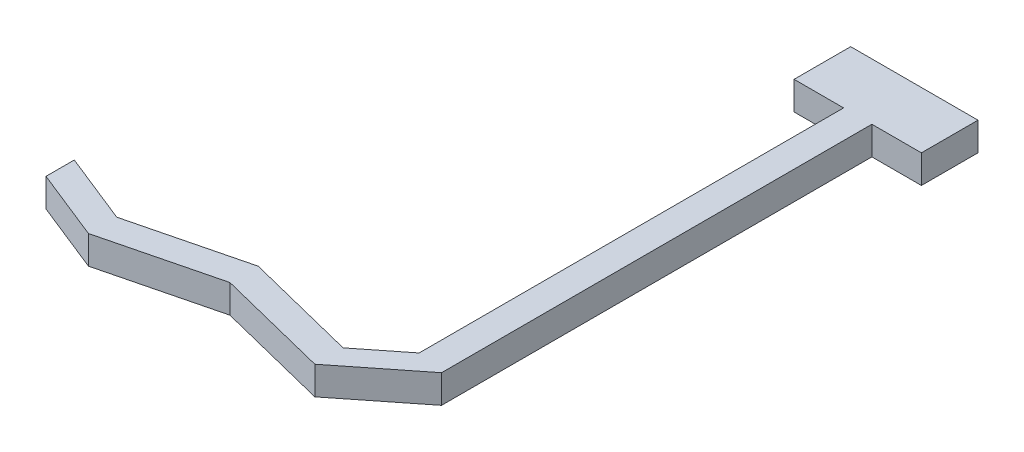
ISO-10303-21;
HEADER;
FILE_DESCRIPTION(('STEP AP214'),'2;1');
FILE_NAME('part.step','',(''),(''),'','','');
FILE_SCHEMA(('AUTOMOTIVE_DESIGN { 1 0 10303 214 1 1 1 1 }'));
ENDSEC;
DATA;
#1=APPLICATION_CONTEXT('core data for automotive mechanical design processes');
#2=APPLICATION_PROTOCOL_DEFINITION('international standard','automotive_design',2000,#1);
#3=PRODUCT_CONTEXT('',#1,'mechanical');
#4=PRODUCT('Part','Part','',(#3));
#5=PRODUCT_RELATED_PRODUCT_CATEGORY('part','',(#4));
#6=PRODUCT_DEFINITION_FORMATION('','',#4);
#7=PRODUCT_DEFINITION_CONTEXT('part definition',#1,'design');
#8=PRODUCT_DEFINITION('design','',#6,#7);
#9=PRODUCT_DEFINITION_SHAPE('','',#8);
#10=(LENGTH_UNIT() NAMED_UNIT(*) SI_UNIT(.MILLI.,.METRE.));
#11=(NAMED_UNIT(*) PLANE_ANGLE_UNIT() SI_UNIT($,.RADIAN.));
#12=(NAMED_UNIT(*) SI_UNIT($,.STERADIAN.) SOLID_ANGLE_UNIT());
#13=UNCERTAINTY_MEASURE_WITH_UNIT(LENGTH_MEASURE(1.E-05),#10,'distance_accuracy_value','');
#14=(GEOMETRIC_REPRESENTATION_CONTEXT(3) GLOBAL_UNCERTAINTY_ASSIGNED_CONTEXT((#13)) GLOBAL_UNIT_ASSIGNED_CONTEXT((#10,
#11,#12)) REPRESENTATION_CONTEXT('',''));
#15=CARTESIAN_POINT('',(0.,0.,0.));
#16=DIRECTION('',(0.,0.,1.));
#17=DIRECTION('',(1.,0.,0.));
#18=AXIS2_PLACEMENT_3D('',#15,#16,#17);
#19=CARTESIAN_POINT('',(-5.,2.,3.95990333794194));
#20=DIRECTION('',(-0.620854250213827,0.,-0.783926016911945));
#21=DIRECTION('',(-0.783926016911945,0.,0.620854250213827));
#22=AXIS2_PLACEMENT_3D('',#19,#20,#21);
#23=PLANE('',#22);
#24=DIRECTION('',(0.783926016911944,0.,-0.620854250213827));
#25=VECTOR('',#24,1.);
#26=CARTESIAN_POINT('',(-5.,0.,3.95990333794194));
#27=LINE('',#26,#25);
#28=CARTESIAN_POINT('',(-5.,0.,3.95990333794194));
#29=VERTEX_POINT('',#28);
#30=CARTESIAN_POINT('',(0.,0.,0.));
#31=VERTEX_POINT('',#30);
#32=EDGE_CURVE('E177',#29,#31,#27,.T.);
#33=ORIENTED_EDGE('',*,*,#32,.T.);
#34=DIRECTION('',(0.,-1.,0.));
#35=VECTOR('',#34,1.);
#36=CARTESIAN_POINT('',(0.,2.,0.));
#37=LINE('',#36,#35);
#38=CARTESIAN_POINT('',(0.,2.,0.));
#39=VERTEX_POINT('',#38);
#40=EDGE_CURVE('E11',#39,#31,#37,.T.);
#41=ORIENTED_EDGE('',*,*,#40,.F.);
#42=DIRECTION('',(0.783926016911944,0.,-0.620854250213827));
#43=VECTOR('',#42,1.);
#44=CARTESIAN_POINT('',(-5.,2.,3.95990333794194));
#45=LINE('',#44,#43);
#46=CARTESIAN_POINT('',(-5.,2.,3.95990333794194));
#47=VERTEX_POINT('',#46);
#48=EDGE_CURVE('E207',#47,#39,#45,.T.);
#49=ORIENTED_EDGE('',*,*,#48,.F.);
#50=DIRECTION('',(0.,-1.,0.));
#51=VECTOR('',#50,1.);
#52=CARTESIAN_POINT('',(-5.,2.,3.95990333794194));
#53=LINE('',#52,#51);
#54=EDGE_CURVE('E173',#47,#29,#53,.T.);
#55=ORIENTED_EDGE('',*,*,#54,.T.);
#56=EDGE_LOOP('',(#33,#41,#49,#55));
#57=FACE_BOUND('',#56,.T.);
#58=ADVANCED_FACE('F33',(#57),#23,.F.);
#59=CARTESIAN_POINT('',(0.,2.,0.));
#60=DIRECTION('',(-1.,0.,0.));
#61=DIRECTION('',(0.,0.,1.));
#62=AXIS2_PLACEMENT_3D('',#59,#60,#61);
#63=PLANE('',#62);
#64=DIRECTION('',(0.,0.,-1.));
#65=VECTOR('',#64,1.);
#66=CARTESIAN_POINT('',(0.,0.,0.));
#67=LINE('',#66,#65);
#68=CARTESIAN_POINT('',(0.,0.,-30.4160386648232));
#69=VERTEX_POINT('',#68);
#70=EDGE_CURVE('E180',#31,#69,#67,.T.);
#71=ORIENTED_EDGE('',*,*,#70,.T.);
#72=DIRECTION('',(0.,-1.,0.));
#73=VECTOR('',#72,1.);
#74=CARTESIAN_POINT('',(0.,2.,-30.4160386648232));
#75=LINE('',#74,#73);
#76=CARTESIAN_POINT('',(0.,2.,-30.4160386648232));
#77=VERTEX_POINT('',#76);
#78=EDGE_CURVE('E41',#77,#69,#75,.T.);
#79=ORIENTED_EDGE('',*,*,#78,.F.);
#80=DIRECTION('',(0.,0.,-1.));
#81=VECTOR('',#80,1.);
#82=CARTESIAN_POINT('',(0.,2.,0.));
#83=LINE('',#82,#81);
#84=EDGE_CURVE('E116',#39,#77,#83,.T.);
#85=ORIENTED_EDGE('',*,*,#84,.F.);
#86=ORIENTED_EDGE('',*,*,#40,.T.);
#87=EDGE_LOOP('',(#71,#79,#85,#86));
#88=FACE_BOUND('',#87,.T.);
#89=ADVANCED_FACE('F305',(#88),#63,.F.);
#90=CARTESIAN_POINT('',(0.,2.,-30.4160386648232));
#91=DIRECTION('',(0.,0.,-1.));
#92=DIRECTION('',(-1.,0.,0.));
#93=AXIS2_PLACEMENT_3D('',#90,#91,#92);
#94=PLANE('',#93);
#95=DIRECTION('',(1.,0.,0.));
#96=VECTOR('',#95,1.);
#97=CARTESIAN_POINT('',(0.,0.,-30.4160386648232));
#98=LINE('',#97,#96);
#99=CARTESIAN_POINT('',(3.5,0.,-30.4160386648232));
#100=VERTEX_POINT('',#99);
#101=EDGE_CURVE('E182',#69,#100,#98,.T.);
#102=ORIENTED_EDGE('',*,*,#101,.T.);
#103=DIRECTION('',(0.,-1.,0.));
#104=VECTOR('',#103,1.);
#105=CARTESIAN_POINT('',(3.5,2.,-30.4160386648232));
#106=LINE('',#105,#104);
#107=CARTESIAN_POINT('',(3.5,2.,-30.4160386648232));
#108=VERTEX_POINT('',#107);
#109=EDGE_CURVE('E238',#108,#100,#106,.T.);
#110=ORIENTED_EDGE('',*,*,#109,.F.);
#111=DIRECTION('',(1.,0.,0.));
#112=VECTOR('',#111,1.);
#113=CARTESIAN_POINT('',(0.,2.,-30.4160386648232));
#114=LINE('',#113,#112);
#115=EDGE_CURVE('E246',#77,#108,#114,.T.);
#116=ORIENTED_EDGE('',*,*,#115,.F.);
#117=ORIENTED_EDGE('',*,*,#78,.T.);
#118=EDGE_LOOP('',(#102,#110,#116,#117));
#119=FACE_BOUND('',#118,.T.);
#120=ADVANCED_FACE('F244',(#119),#94,.F.);
#121=CARTESIAN_POINT('',(3.5,2.,-30.4160386648232));
#122=DIRECTION('',(-1.,0.,0.));
#123=DIRECTION('',(0.,0.,1.));
#124=AXIS2_PLACEMENT_3D('',#121,#122,#123);
#125=PLANE('',#124);
#126=DIRECTION('',(0.,0.,-1.));
#127=VECTOR('',#126,1.);
#128=CARTESIAN_POINT('',(3.5,0.,-30.4160386648232));
#129=LINE('',#128,#127);
#130=CARTESIAN_POINT('',(3.5,0.,-34.4160386648232));
#131=VERTEX_POINT('',#130);
#132=EDGE_CURVE('E184',#100,#131,#129,.T.);
#133=ORIENTED_EDGE('',*,*,#132,.T.);
#134=DIRECTION('',(0.,-1.,0.));
#135=VECTOR('',#134,1.);
#136=CARTESIAN_POINT('',(3.5,2.,-34.4160386648232));
#137=LINE('',#136,#135);
#138=CARTESIAN_POINT('',(3.5,2.,-34.4160386648232));
#139=VERTEX_POINT('',#138);
#140=EDGE_CURVE('E235',#139,#131,#137,.T.);
#141=ORIENTED_EDGE('',*,*,#140,.F.);
#142=DIRECTION('',(0.,0.,-1.));
#143=VECTOR('',#142,1.);
#144=CARTESIAN_POINT('',(3.5,2.,-30.4160386648232));
#145=LINE('',#144,#143);
#146=EDGE_CURVE('E264',#108,#139,#145,.T.);
#147=ORIENTED_EDGE('',*,*,#146,.F.);
#148=ORIENTED_EDGE('',*,*,#109,.T.);
#149=EDGE_LOOP('',(#133,#141,#147,#148));
#150=FACE_BOUND('',#149,.T.);
#151=ADVANCED_FACE('F255',(#150),#125,.F.);
#152=CARTESIAN_POINT('',(3.5,2.,-34.4160386648232));
#153=DIRECTION('',(0.,0.,1.));
#154=DIRECTION('',(1.,0.,0.));
#155=AXIS2_PLACEMENT_3D('',#152,#153,#154);
#156=PLANE('',#155);
#157=DIRECTION('',(-1.,0.,0.));
#158=VECTOR('',#157,1.);
#159=CARTESIAN_POINT('',(3.5,0.,-34.4160386648232));
#160=LINE('',#159,#158);
#161=CARTESIAN_POINT('',(-5.5,0.,-34.4160386648232));
#162=VERTEX_POINT('',#161);
#163=EDGE_CURVE('E186',#131,#162,#160,.T.);
#164=ORIENTED_EDGE('',*,*,#163,.T.);
#165=DIRECTION('',(0.,-1.,0.));
#166=VECTOR('',#165,1.);
#167=CARTESIAN_POINT('',(-5.5,2.,-34.4160386648232));
#168=LINE('',#167,#166);
#169=CARTESIAN_POINT('',(-5.5,2.,-34.4160386648232));
#170=VERTEX_POINT('',#169);
#171=EDGE_CURVE('E232',#170,#162,#168,.T.);
#172=ORIENTED_EDGE('',*,*,#171,.F.);
#173=DIRECTION('',(-1.,0.,0.));
#174=VECTOR('',#173,1.);
#175=CARTESIAN_POINT('',(3.5,2.,-34.4160386648232));
#176=LINE('',#175,#174);
#177=EDGE_CURVE('E261',#139,#170,#176,.T.);
#178=ORIENTED_EDGE('',*,*,#177,.F.);
#179=ORIENTED_EDGE('',*,*,#140,.T.);
#180=EDGE_LOOP('',(#164,#172,#178,#179));
#181=FACE_BOUND('',#180,.T.);
#182=ADVANCED_FACE('F259',(#181),#156,.F.);
#183=CARTESIAN_POINT('',(-5.5,2.,-34.4160386648232));
#184=DIRECTION('',(1.,0.,0.));
#185=DIRECTION('',(0.,0.,-1.));
#186=AXIS2_PLACEMENT_3D('',#183,#184,#185);
#187=PLANE('',#186);
#188=DIRECTION('',(0.,0.,1.));
#189=VECTOR('',#188,1.);
#190=CARTESIAN_POINT('',(-5.5,0.,-34.4160386648232));
#191=LINE('',#190,#189);
#192=CARTESIAN_POINT('',(-5.5,0.,-30.4160386648232));
#193=VERTEX_POINT('',#192);
#194=EDGE_CURVE('E188',#162,#193,#191,.T.);
#195=ORIENTED_EDGE('',*,*,#194,.T.);
#196=DIRECTION('',(0.,-1.,0.));
#197=VECTOR('',#196,1.);
#198=CARTESIAN_POINT('',(-5.5,2.,-30.4160386648232));
#199=LINE('',#198,#197);
#200=CARTESIAN_POINT('',(-5.5,2.,-30.4160386648232));
#201=VERTEX_POINT('',#200);
#202=EDGE_CURVE('E229',#201,#193,#199,.T.);
#203=ORIENTED_EDGE('',*,*,#202,.F.);
#204=DIRECTION('',(0.,0.,1.));
#205=VECTOR('',#204,1.);
#206=CARTESIAN_POINT('',(-5.5,2.,-34.4160386648232));
#207=LINE('',#206,#205);
#208=EDGE_CURVE('E263',#170,#201,#207,.T.);
#209=ORIENTED_EDGE('',*,*,#208,.F.);
#210=ORIENTED_EDGE('',*,*,#171,.T.);
#211=EDGE_LOOP('',(#195,#203,#209,#210));
#212=FACE_BOUND('',#211,.T.);
#213=ADVANCED_FACE('F318',(#212),#187,.F.);
#214=CARTESIAN_POINT('',(-5.5,2.,-30.4160386648232));
#215=DIRECTION('',(0.,0.,-1.));
#216=DIRECTION('',(-1.,0.,0.));
#217=AXIS2_PLACEMENT_3D('',#214,#215,#216);
#218=PLANE('',#217);
#219=DIRECTION('',(1.,0.,0.));
#220=VECTOR('',#219,1.);
#221=CARTESIAN_POINT('',(-5.5,0.,-30.4160386648232));
#222=LINE('',#221,#220);
#223=CARTESIAN_POINT('',(-2.,0.,-30.4160386648232));
#224=VERTEX_POINT('',#223);
#225=EDGE_CURVE('E190',#193,#224,#222,.T.);
#226=ORIENTED_EDGE('',*,*,#225,.T.);
#227=DIRECTION('',(0.,-1.,0.));
#228=VECTOR('',#227,1.);
#229=CARTESIAN_POINT('',(-2.,2.,-30.4160386648232));
#230=LINE('',#229,#228);
#231=CARTESIAN_POINT('',(-2.,2.,-30.4160386648232));
#232=VERTEX_POINT('',#231);
#233=EDGE_CURVE('E226',#232,#224,#230,.T.);
#234=ORIENTED_EDGE('',*,*,#233,.F.);
#235=DIRECTION('',(1.,0.,0.));
#236=VECTOR('',#235,1.);
#237=CARTESIAN_POINT('',(-5.5,2.,-30.4160386648232));
#238=LINE('',#237,#236);
#239=EDGE_CURVE('E266',#201,#232,#238,.T.);
#240=ORIENTED_EDGE('',*,*,#239,.F.);
#241=ORIENTED_EDGE('',*,*,#202,.T.);
#242=EDGE_LOOP('',(#226,#234,#240,#241));
#243=FACE_BOUND('',#242,.T.);
#244=ADVANCED_FACE('F321',(#243),#218,.F.);
#245=CARTESIAN_POINT('',(-2.,2.,-30.4160386648232));
#246=DIRECTION('',(1.,0.,0.));
#247=DIRECTION('',(0.,0.,-1.));
#248=AXIS2_PLACEMENT_3D('',#245,#246,#247);
#249=PLANE('',#248);
#250=DIRECTION('',(0.,0.,1.));
#251=VECTOR('',#250,1.);
#252=CARTESIAN_POINT('',(-2.,0.,-30.4160386648232));
#253=LINE('',#252,#251);
#254=CARTESIAN_POINT('',(-2.,0.,-0.416038664823226));
#255=VERTEX_POINT('',#254);
#256=EDGE_CURVE('E192',#224,#255,#253,.T.);
#257=ORIENTED_EDGE('',*,*,#256,.T.);
#258=DIRECTION('',(0.,-1.,0.));
#259=VECTOR('',#258,1.);
#260=CARTESIAN_POINT('',(-2.,2.,-0.416038664823226));
#261=LINE('',#260,#259);
#262=CARTESIAN_POINT('',(-2.,2.,-0.416038664823226));
#263=VERTEX_POINT('',#262);
#264=EDGE_CURVE('E223',#263,#255,#261,.T.);
#265=ORIENTED_EDGE('',*,*,#264,.F.);
#266=DIRECTION('',(0.,0.,1.));
#267=VECTOR('',#266,1.);
#268=CARTESIAN_POINT('',(-2.,2.,-30.4160386648232));
#269=LINE('',#268,#267);
#270=EDGE_CURVE('E272',#232,#263,#269,.T.);
#271=ORIENTED_EDGE('',*,*,#270,.F.);
#272=ORIENTED_EDGE('',*,*,#233,.T.);
#273=EDGE_LOOP('',(#257,#265,#271,#272));
#274=FACE_BOUND('',#273,.T.);
#275=ADVANCED_FACE('F325',(#274),#249,.F.);
#276=CARTESIAN_POINT('',(-2.,2.,-0.416038664823226));
#277=DIRECTION('',(0.620854250213828,0.,0.783926016911944));
#278=DIRECTION('',(0.783926016911944,0.,-0.620854250213828));
#279=AXIS2_PLACEMENT_3D('',#276,#277,#278);
#280=PLANE('',#279);
#281=DIRECTION('',(-0.783926016911944,0.,0.620854250213828));
#282=VECTOR('',#281,1.);
#283=CARTESIAN_POINT('',(-2.,0.,-0.416038664823226));
#284=LINE('',#283,#282);
#285=CARTESIAN_POINT('',(-5.,0.,1.95990333794194));
#286=VERTEX_POINT('',#285);
#287=EDGE_CURVE('E194',#255,#286,#284,.T.);
#288=ORIENTED_EDGE('',*,*,#287,.T.);
#289=DIRECTION('',(0.,-1.,0.));
#290=VECTOR('',#289,1.);
#291=CARTESIAN_POINT('',(-5.,2.,1.95990333794194));
#292=LINE('',#291,#290);
#293=CARTESIAN_POINT('',(-5.,2.,1.95990333794194));
#294=VERTEX_POINT('',#293);
#295=EDGE_CURVE('E220',#294,#286,#292,.T.);
#296=ORIENTED_EDGE('',*,*,#295,.F.);
#297=DIRECTION('',(-0.783926016911944,0.,0.620854250213828));
#298=VECTOR('',#297,1.);
#299=CARTESIAN_POINT('',(-2.,2.,-0.416038664823226));
#300=LINE('',#299,#298);
#301=EDGE_CURVE('E274',#263,#294,#300,.T.);
#302=ORIENTED_EDGE('',*,*,#301,.F.);
#303=ORIENTED_EDGE('',*,*,#264,.T.);
#304=EDGE_LOOP('',(#288,#296,#302,#303));
#305=FACE_BOUND('',#304,.T.);
#306=ADVANCED_FACE('F329',(#305),#280,.F.);
#307=CARTESIAN_POINT('',(-5.,2.,1.95990333794194));
#308=DIRECTION('',(-0.242535625036333,0.,0.970142500145332));
#309=DIRECTION('',(0.970142500145332,0.,0.242535625036333));
#310=AXIS2_PLACEMENT_3D('',#307,#308,#309);
#311=PLANE('',#310);
#312=DIRECTION('',(-0.970142500145332,0.,-0.242535625036333));
#313=VECTOR('',#312,1.);
#314=CARTESIAN_POINT('',(-5.,0.,1.95990333794194));
#315=LINE('',#314,#313);
#316=CARTESIAN_POINT('',(-13.,0.,-0.0400966620580628));
#317=VERTEX_POINT('',#316);
#318=EDGE_CURVE('E196',#286,#317,#315,.T.);
#319=ORIENTED_EDGE('',*,*,#318,.T.);
#320=DIRECTION('',(0.,-1.,0.));
#321=VECTOR('',#320,1.);
#322=CARTESIAN_POINT('',(-13.,2.,-0.0400966620580628));
#323=LINE('',#322,#321);
#324=CARTESIAN_POINT('',(-13.,2.,-0.0400966620580628));
#325=VERTEX_POINT('',#324);
#326=EDGE_CURVE('E217',#325,#317,#323,.T.);
#327=ORIENTED_EDGE('',*,*,#326,.F.);
#328=DIRECTION('',(-0.970142500145332,0.,-0.242535625036333));
#329=VECTOR('',#328,1.);
#330=CARTESIAN_POINT('',(-5.,2.,1.95990333794194));
#331=LINE('',#330,#329);
#332=EDGE_CURVE('E276',#294,#325,#331,.T.);
#333=ORIENTED_EDGE('',*,*,#332,.F.);
#334=ORIENTED_EDGE('',*,*,#295,.T.);
#335=EDGE_LOOP('',(#319,#327,#333,#334));
#336=FACE_BOUND('',#335,.T.);
#337=ADVANCED_FACE('F333',(#336),#311,.F.);
#338=CARTESIAN_POINT('',(-13.,2.,-0.0400966620580628));
#339=DIRECTION('',(0.242535625036333,0.,0.970142500145332));
#340=DIRECTION('',(0.970142500145332,0.,-0.242535625036333));
#341=AXIS2_PLACEMENT_3D('',#338,#339,#340);
#342=PLANE('',#341);
#343=DIRECTION('',(-0.970142500145332,0.,0.242535625036333));
#344=VECTOR('',#343,1.);
#345=CARTESIAN_POINT('',(-13.,0.,-0.0400966620580628));
#346=LINE('',#345,#344);
#347=CARTESIAN_POINT('',(-21.,0.,1.95990333794194));
#348=VERTEX_POINT('',#347);
#349=EDGE_CURVE('E198',#317,#348,#346,.T.);
#350=ORIENTED_EDGE('',*,*,#349,.T.);
#351=DIRECTION('',(0.,-1.,0.));
#352=VECTOR('',#351,1.);
#353=CARTESIAN_POINT('',(-21.,2.,1.95990333794194));
#354=LINE('',#353,#352);
#355=CARTESIAN_POINT('',(-21.,2.,1.95990333794194));
#356=VERTEX_POINT('',#355);
#357=EDGE_CURVE('E214',#356,#348,#354,.T.);
#358=ORIENTED_EDGE('',*,*,#357,.F.);
#359=DIRECTION('',(-0.970142500145332,0.,0.242535625036333));
#360=VECTOR('',#359,1.);
#361=CARTESIAN_POINT('',(-13.,2.,-0.0400966620580628));
#362=LINE('',#361,#360);
#363=EDGE_CURVE('E278',#325,#356,#362,.T.);
#364=ORIENTED_EDGE('',*,*,#363,.F.);
#365=ORIENTED_EDGE('',*,*,#326,.T.);
#366=EDGE_LOOP('',(#350,#358,#364,#365));
#367=FACE_BOUND('',#366,.T.);
#368=ADVANCED_FACE('F337',(#367),#342,.F.);
#369=CARTESIAN_POINT('',(-21.,2.,1.95990333794194));
#370=DIRECTION('',(-0.371390676354104,0.,0.928476690885259));
#371=DIRECTION('',(0.928476690885259,0.,0.371390676354104));
#372=AXIS2_PLACEMENT_3D('',#369,#370,#371);
#373=PLANE('',#372);
#374=DIRECTION('',(-0.928476690885259,0.,-0.371390676354104));
#375=VECTOR('',#374,1.);
#376=CARTESIAN_POINT('',(-21.,0.,1.95990333794194));
#377=LINE('',#376,#375);
#378=CARTESIAN_POINT('',(-26.,0.,-0.0400966620580628));
#379=VERTEX_POINT('',#378);
#380=EDGE_CURVE('E200',#348,#379,#377,.T.);
#381=ORIENTED_EDGE('',*,*,#380,.T.);
#382=DIRECTION('',(0.,-1.,0.));
#383=VECTOR('',#382,1.);
#384=CARTESIAN_POINT('',(-26.,2.,-0.0400966620580628));
#385=LINE('',#384,#383);
#386=CARTESIAN_POINT('',(-26.,2.,-0.0400966620580628));
#387=VERTEX_POINT('',#386);
#388=EDGE_CURVE('E211',#387,#379,#385,.T.);
#389=ORIENTED_EDGE('',*,*,#388,.F.);
#390=DIRECTION('',(-0.928476690885259,0.,-0.371390676354104));
#391=VECTOR('',#390,1.);
#392=CARTESIAN_POINT('',(-21.,2.,1.95990333794194));
#393=LINE('',#392,#391);
#394=EDGE_CURVE('E280',#356,#387,#393,.T.);
#395=ORIENTED_EDGE('',*,*,#394,.F.);
#396=ORIENTED_EDGE('',*,*,#357,.T.);
#397=EDGE_LOOP('',(#381,#389,#395,#396));
#398=FACE_BOUND('',#397,.T.);
#399=ADVANCED_FACE('F286',(#398),#373,.F.);
#400=CARTESIAN_POINT('',(-26.,2.,-0.0400966620580628));
#401=DIRECTION('',(1.,0.,0.));
#402=DIRECTION('',(0.,0.,-1.));
#403=AXIS2_PLACEMENT_3D('',#400,#401,#402);
#404=PLANE('',#403);
#405=DIRECTION('',(0.,0.,1.));
#406=VECTOR('',#405,1.);
#407=CARTESIAN_POINT('',(-26.,0.,-0.0400966620580628));
#408=LINE('',#407,#406);
#409=CARTESIAN_POINT('',(-26.,0.,1.95990333794194));
#410=VERTEX_POINT('',#409);
#411=EDGE_CURVE('E202',#379,#410,#408,.T.);
#412=ORIENTED_EDGE('',*,*,#411,.T.);
#413=DIRECTION('',(0.,-1.,0.));
#414=VECTOR('',#413,1.);
#415=CARTESIAN_POINT('',(-26.,2.,1.95990333794194));
#416=LINE('',#415,#414);
#417=CARTESIAN_POINT('',(-26.,2.,1.95990333794194));
#418=VERTEX_POINT('',#417);
#419=EDGE_CURVE('E168',#418,#410,#416,.T.);
#420=ORIENTED_EDGE('',*,*,#419,.F.);
#421=DIRECTION('',(0.,0.,1.));
#422=VECTOR('',#421,1.);
#423=CARTESIAN_POINT('',(-26.,2.,-0.0400966620580628));
#424=LINE('',#423,#422);
#425=EDGE_CURVE('E159',#387,#418,#424,.T.);
#426=ORIENTED_EDGE('',*,*,#425,.F.);
#427=ORIENTED_EDGE('',*,*,#388,.T.);
#428=EDGE_LOOP('',(#412,#420,#426,#427));
#429=FACE_BOUND('',#428,.T.);
#430=ADVANCED_FACE('F290',(#429),#404,.F.);
#431=CARTESIAN_POINT('',(-26.,2.,1.95990333794194));
#432=DIRECTION('',(0.371390676354104,0.,-0.928476690885259));
#433=DIRECTION('',(-0.928476690885259,0.,-0.371390676354104));
#434=AXIS2_PLACEMENT_3D('',#431,#432,#433);
#435=PLANE('',#434);
#436=DIRECTION('',(0.928476690885259,0.,0.371390676354104));
#437=VECTOR('',#436,1.);
#438=CARTESIAN_POINT('',(-26.,0.,1.95990333794194));
#439=LINE('',#438,#437);
#440=CARTESIAN_POINT('',(-21.,0.,3.95990333794194));
#441=VERTEX_POINT('',#440);
#442=EDGE_CURVE('E167',#410,#441,#439,.T.);
#443=ORIENTED_EDGE('',*,*,#442,.T.);
#444=DIRECTION('',(0.,-1.,0.));
#445=VECTOR('',#444,1.);
#446=CARTESIAN_POINT('',(-21.,2.,3.95990333794194));
#447=LINE('',#446,#445);
#448=CARTESIAN_POINT('',(-21.,2.,3.95990333794194));
#449=VERTEX_POINT('',#448);
#450=EDGE_CURVE('E164',#449,#441,#447,.T.);
#451=ORIENTED_EDGE('',*,*,#450,.F.);
#452=DIRECTION('',(0.928476690885259,0.,0.371390676354104));
#453=VECTOR('',#452,1.);
#454=CARTESIAN_POINT('',(-26.,2.,1.95990333794194));
#455=LINE('',#454,#453);
#456=EDGE_CURVE('E153',#418,#449,#455,.T.);
#457=ORIENTED_EDGE('',*,*,#456,.F.);
#458=ORIENTED_EDGE('',*,*,#419,.T.);
#459=EDGE_LOOP('',(#443,#451,#457,#458));
#460=FACE_BOUND('',#459,.T.);
#461=ADVANCED_FACE('F165',(#460),#435,.F.);
#462=CARTESIAN_POINT('',(-21.,2.,3.95990333794194));
#463=DIRECTION('',(-0.242535625036333,0.,-0.970142500145332));
#464=DIRECTION('',(-0.970142500145332,0.,0.242535625036333));
#465=AXIS2_PLACEMENT_3D('',#462,#463,#464);
#466=PLANE('',#465);
#467=DIRECTION('',(0.970142500145332,0.,-0.242535625036333));
#468=VECTOR('',#467,1.);
#469=CARTESIAN_POINT('',(-21.,0.,3.95990333794194));
#470=LINE('',#469,#468);
#471=CARTESIAN_POINT('',(-13.,0.,1.95990333794194));
#472=VERTEX_POINT('',#471);
#473=EDGE_CURVE('E102',#441,#472,#470,.T.);
#474=ORIENTED_EDGE('',*,*,#473,.T.);
#475=DIRECTION('',(0.,-1.,0.));
#476=VECTOR('',#475,1.);
#477=CARTESIAN_POINT('',(-13.,2.,1.95990333794194));
#478=LINE('',#477,#476);
#479=CARTESIAN_POINT('',(-13.,2.,1.95990333794194));
#480=VERTEX_POINT('',#479);
#481=EDGE_CURVE('E169',#480,#472,#478,.T.);
#482=ORIENTED_EDGE('',*,*,#481,.F.);
#483=DIRECTION('',(0.970142500145332,0.,-0.242535625036333));
#484=VECTOR('',#483,1.);
#485=CARTESIAN_POINT('',(-21.,2.,3.95990333794194));
#486=LINE('',#485,#484);
#487=EDGE_CURVE('E157',#449,#480,#486,.T.);
#488=ORIENTED_EDGE('',*,*,#487,.F.);
#489=ORIENTED_EDGE('',*,*,#450,.T.);
#490=EDGE_LOOP('',(#474,#482,#488,#489));
#491=FACE_BOUND('',#490,.T.);
#492=ADVANCED_FACE('F171',(#491),#466,.F.);
#493=CARTESIAN_POINT('',(-13.,2.,1.95990333794194));
#494=DIRECTION('',(0.242535625036333,0.,-0.970142500145332));
#495=DIRECTION('',(-0.970142500145332,0.,-0.242535625036333));
#496=AXIS2_PLACEMENT_3D('',#493,#494,#495);
#497=PLANE('',#496);
#498=DIRECTION('',(0.970142500145332,0.,0.242535625036333));
#499=VECTOR('',#498,1.);
#500=CARTESIAN_POINT('',(-13.,0.,1.95990333794194));
#501=LINE('',#500,#499);
#502=EDGE_CURVE('E108',#472,#29,#501,.T.);
#503=ORIENTED_EDGE('',*,*,#502,.T.);
#504=ORIENTED_EDGE('',*,*,#54,.F.);
#505=DIRECTION('',(0.970142500145332,0.,0.242535625036333));
#506=VECTOR('',#505,1.);
#507=CARTESIAN_POINT('',(-13.,2.,1.95990333794194));
#508=LINE('',#507,#506);
#509=EDGE_CURVE('E49',#480,#47,#508,.T.);
#510=ORIENTED_EDGE('',*,*,#509,.F.);
#511=ORIENTED_EDGE('',*,*,#481,.T.);
#512=EDGE_LOOP('',(#503,#504,#510,#511));
#513=FACE_BOUND('',#512,.T.);
#514=ADVANCED_FACE('F294',(#513),#497,.F.);
#515=CARTESIAN_POINT('',(0.,2.,0.));
#516=DIRECTION('',(0.,1.,0.));
#517=DIRECTION('',(0.,0.,1.));
#518=AXIS2_PLACEMENT_3D('',#515,#516,#517);
#519=PLANE('',#518);
#520=ORIENTED_EDGE('',*,*,#48,.T.);
#521=ORIENTED_EDGE('',*,*,#84,.T.);
#522=ORIENTED_EDGE('',*,*,#115,.T.);
#523=ORIENTED_EDGE('',*,*,#146,.T.);
#524=ORIENTED_EDGE('',*,*,#177,.T.);
#525=ORIENTED_EDGE('',*,*,#208,.T.);
#526=ORIENTED_EDGE('',*,*,#239,.T.);
#527=ORIENTED_EDGE('',*,*,#270,.T.);
#528=ORIENTED_EDGE('',*,*,#301,.T.);
#529=ORIENTED_EDGE('',*,*,#332,.T.);
#530=ORIENTED_EDGE('',*,*,#363,.T.);
#531=ORIENTED_EDGE('',*,*,#394,.T.);
#532=ORIENTED_EDGE('',*,*,#425,.T.);
#533=ORIENTED_EDGE('',*,*,#456,.T.);
#534=ORIENTED_EDGE('',*,*,#487,.T.);
#535=ORIENTED_EDGE('',*,*,#509,.T.);
#536=EDGE_LOOP('',(#520,#521,#522,#523,#524,#525,#526,#527,#528,#529,#530,#531,#532,#533,#534,#535));
#537=FACE_BOUND('',#536,.T.);
#538=ADVANCED_FACE('F155',(#537),#519,.T.);
#539=CARTESIAN_POINT('',(0.,0.,0.));
#540=DIRECTION('',(0.,1.,0.));
#541=DIRECTION('',(0.,0.,1.));
#542=AXIS2_PLACEMENT_3D('',#539,#540,#541);
#543=PLANE('',#542);
#544=ORIENTED_EDGE('',*,*,#32,.F.);
#545=ORIENTED_EDGE('',*,*,#502,.F.);
#546=ORIENTED_EDGE('',*,*,#473,.F.);
#547=ORIENTED_EDGE('',*,*,#442,.F.);
#548=ORIENTED_EDGE('',*,*,#411,.F.);
#549=ORIENTED_EDGE('',*,*,#380,.F.);
#550=ORIENTED_EDGE('',*,*,#349,.F.);
#551=ORIENTED_EDGE('',*,*,#318,.F.);
#552=ORIENTED_EDGE('',*,*,#287,.F.);
#553=ORIENTED_EDGE('',*,*,#256,.F.);
#554=ORIENTED_EDGE('',*,*,#225,.F.);
#555=ORIENTED_EDGE('',*,*,#194,.F.);
#556=ORIENTED_EDGE('',*,*,#163,.F.);
#557=ORIENTED_EDGE('',*,*,#132,.F.);
#558=ORIENTED_EDGE('',*,*,#101,.F.);
#559=ORIENTED_EDGE('',*,*,#70,.F.);
#560=EDGE_LOOP('',(#544,#545,#546,#547,#548,#549,#550,#551,#552,#553,#554,#555,#556,#557,#558,#559));
#561=FACE_BOUND('',#560,.T.);
#562=ADVANCED_FACE('F250',(#561),#543,.F.);
#563=CLOSED_SHELL('',(#58,#89,#120,#151,#182,#213,#244,#275,#306,#337,#368,#399,#430,#461,#492,
#514,#538,#562));
#564=MANIFOLD_SOLID_BREP('B2',#563);
#565=ADVANCED_BREP_SHAPE_REPRESENTATION('',(#18,#564),#14);
#566=SHAPE_DEFINITION_REPRESENTATION(#9,#565);
ENDSEC;
END-ISO-10303-21;
